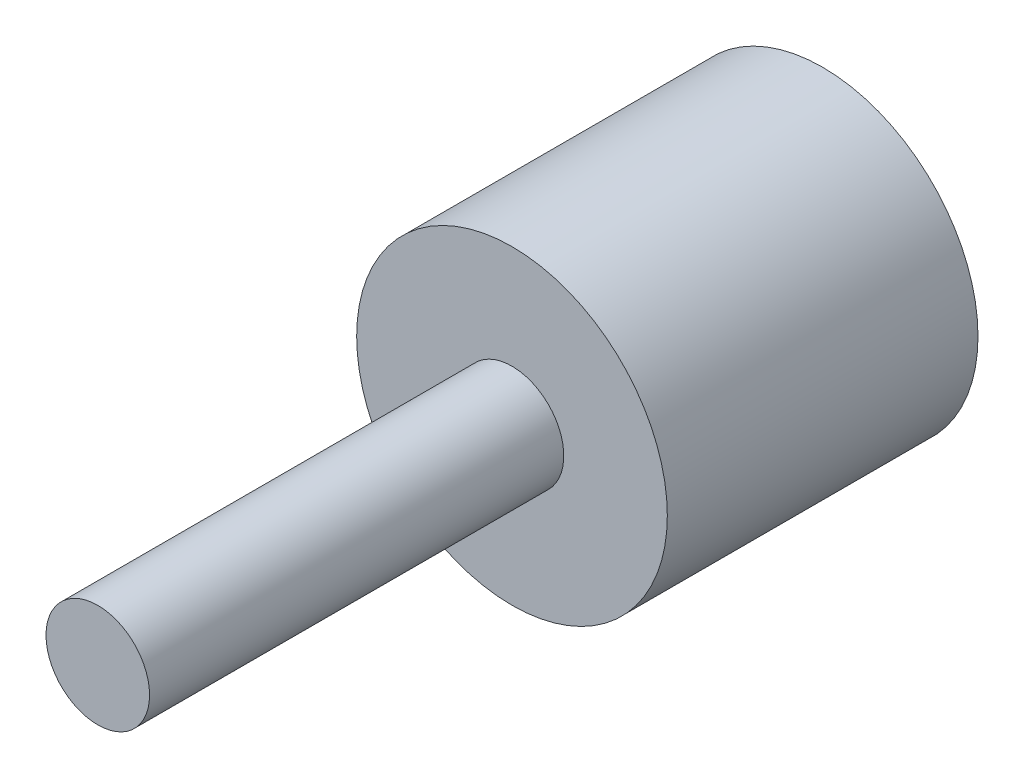
ISO-10303-21;
HEADER;
FILE_DESCRIPTION(('STEP AP214'),'2;1');
FILE_NAME('part.step','',(''),(''),'','','');
FILE_SCHEMA(('AUTOMOTIVE_DESIGN { 1 0 10303 214 1 1 1 1 }'));
ENDSEC;
DATA;
#1=APPLICATION_CONTEXT('core data for automotive mechanical design processes');
#2=APPLICATION_PROTOCOL_DEFINITION('international standard','automotive_design',2000,#1);
#3=PRODUCT_CONTEXT('',#1,'mechanical');
#4=PRODUCT('Part','Part','',(#3));
#5=PRODUCT_RELATED_PRODUCT_CATEGORY('part','',(#4));
#6=PRODUCT_DEFINITION_FORMATION('','',#4);
#7=PRODUCT_DEFINITION_CONTEXT('part definition',#1,'design');
#8=PRODUCT_DEFINITION('design','',#6,#7);
#9=PRODUCT_DEFINITION_SHAPE('','',#8);
#10=(LENGTH_UNIT() NAMED_UNIT(*) SI_UNIT(.MILLI.,.METRE.));
#11=(NAMED_UNIT(*) PLANE_ANGLE_UNIT() SI_UNIT($,.RADIAN.));
#12=(NAMED_UNIT(*) SI_UNIT($,.STERADIAN.) SOLID_ANGLE_UNIT());
#13=UNCERTAINTY_MEASURE_WITH_UNIT(LENGTH_MEASURE(1.E-05),#10,'distance_accuracy_value','');
#14=(GEOMETRIC_REPRESENTATION_CONTEXT(3) GLOBAL_UNCERTAINTY_ASSIGNED_CONTEXT((#13)) GLOBAL_UNIT_ASSIGNED_CONTEXT((#10,
#11,#12)) REPRESENTATION_CONTEXT('',''));
#15=CARTESIAN_POINT('',(0.,0.,0.));
#16=DIRECTION('',(0.,0.,1.));
#17=DIRECTION('',(1.,0.,0.));
#18=AXIS2_PLACEMENT_3D('',#15,#16,#17);
#19=CARTESIAN_POINT('',(0.,0.,15.));
#20=DIRECTION('',(0.,0.,-1.));
#21=DIRECTION('',(-1.,0.,0.));
#22=AXIS2_PLACEMENT_3D('',#19,#20,#21);
#23=CYLINDRICAL_SURFACE('',#22,7.5);
#24=CARTESIAN_POINT('',(0.,0.,15.));
#25=DIRECTION('',(0.,0.,1.));
#26=DIRECTION('',(1.,0.,0.));
#27=AXIS2_PLACEMENT_3D('',#24,#25,#26);
#28=CIRCLE('',#27,7.5);
#29=CARTESIAN_POINT('',(7.5,0.,15.));
#30=VERTEX_POINT('',#29);
#31=EDGE_CURVE('E47',#30,#30,#28,.T.);
#32=ORIENTED_EDGE('',*,*,#31,.F.);
#33=EDGE_LOOP('',(#32));
#34=FACE_BOUND('',#33,.T.);
#35=CARTESIAN_POINT('',(0.,0.,0.));
#36=DIRECTION('',(0.,0.,1.));
#37=DIRECTION('',(1.,0.,0.));
#38=AXIS2_PLACEMENT_3D('',#35,#36,#37);
#39=CIRCLE('',#38,7.5);
#40=CARTESIAN_POINT('',(7.5,0.,0.));
#41=VERTEX_POINT('',#40);
#42=EDGE_CURVE('E53',#41,#41,#39,.T.);
#43=ORIENTED_EDGE('',*,*,#42,.T.);
#44=EDGE_LOOP('',(#43));
#45=FACE_BOUND('',#44,.T.);
#46=ADVANCED_FACE('F39',(#34,#45),#23,.T.);
#47=CARTESIAN_POINT('',(0.,0.,15.));
#48=DIRECTION('',(0.,0.,1.));
#49=DIRECTION('',(1.,0.,0.));
#50=AXIS2_PLACEMENT_3D('',#47,#48,#49);
#51=PLANE('',#50);
#52=CARTESIAN_POINT('',(0.,0.,15.));
#53=DIRECTION('',(0.,0.,-1.));
#54=DIRECTION('',(-1.,0.,0.));
#55=AXIS2_PLACEMENT_3D('',#52,#53,#54);
#56=CIRCLE('',#55,2.5);
#57=CARTESIAN_POINT('',(-2.5,0.,15.));
#58=VERTEX_POINT('',#57);
#59=EDGE_CURVE('E43',#58,#58,#56,.T.);
#60=ORIENTED_EDGE('',*,*,#59,.T.);
#61=EDGE_LOOP('',(#60));
#62=FACE_BOUND('',#61,.T.);
#63=ORIENTED_EDGE('',*,*,#31,.T.);
#64=EDGE_LOOP('',(#63));
#65=FACE_BOUND('',#64,.T.);
#66=ADVANCED_FACE('F60',(#62,#65),#51,.T.);
#67=CARTESIAN_POINT('',(0.,0.,0.));
#68=DIRECTION('',(0.,0.,1.));
#69=DIRECTION('',(1.,0.,0.));
#70=AXIS2_PLACEMENT_3D('',#67,#68,#69);
#71=PLANE('',#70);
#72=CARTESIAN_POINT('',(0.,0.,0.));
#73=DIRECTION('',(0.,0.,-1.));
#74=DIRECTION('',(-1.,0.,0.));
#75=AXIS2_PLACEMENT_3D('',#72,#73,#74);
#76=CIRCLE('',#75,2.5);
#77=CARTESIAN_POINT('',(-2.5,0.,0.));
#78=VERTEX_POINT('',#77);
#79=EDGE_CURVE('E11',#78,#78,#76,.T.);
#80=ORIENTED_EDGE('',*,*,#79,.F.);
#81=EDGE_LOOP('',(#80));
#82=FACE_BOUND('',#81,.T.);
#83=ORIENTED_EDGE('',*,*,#42,.F.);
#84=EDGE_LOOP('',(#83));
#85=FACE_BOUND('',#84,.T.);
#86=ADVANCED_FACE('F64',(#82,#85),#71,.F.);
#87=CARTESIAN_POINT('',(0.,0.,15.));
#88=DIRECTION('',(0.,0.,-1.));
#89=DIRECTION('',(-1.,0.,0.));
#90=AXIS2_PLACEMENT_3D('',#87,#88,#89);
#91=CYLINDRICAL_SURFACE('',#90,2.5);
#92=ORIENTED_EDGE('',*,*,#59,.F.);
#93=EDGE_LOOP('',(#92));
#94=FACE_BOUND('',#93,.T.);
#95=ORIENTED_EDGE('',*,*,#79,.T.);
#96=EDGE_LOOP('',(#95));
#97=FACE_BOUND('',#96,.T.);
#98=ADVANCED_FACE('F41',(#94,#97),#91,.F.);
#99=CLOSED_SHELL('',(#46,#66,#86,#98));
#100=MANIFOLD_SOLID_BREP('B2',#99);
#101=CARTESIAN_POINT('',(0.,0.,35.));
#102=DIRECTION('',(0.,0.,1.));
#103=DIRECTION('',(1.,0.,0.));
#104=AXIS2_PLACEMENT_3D('',#101,#102,#103);
#105=PLANE('',#104);
#106=CARTESIAN_POINT('',(0.,0.,35.));
#107=DIRECTION('',(0.,0.,1.));
#108=DIRECTION('',(1.,0.,0.));
#109=AXIS2_PLACEMENT_3D('',#106,#107,#108);
#110=CIRCLE('',#109,2.5);
#111=CARTESIAN_POINT('',(2.5,0.,35.));
#112=VERTEX_POINT('',#111);
#113=EDGE_CURVE('E38',#112,#112,#110,.T.);
#114=ORIENTED_EDGE('',*,*,#113,.T.);
#115=EDGE_LOOP('',(#114));
#116=FACE_BOUND('',#115,.T.);
#117=ADVANCED_FACE('F101',(#116),#105,.T.);
#118=CARTESIAN_POINT('',(0.,0.,35.));
#119=DIRECTION('',(0.,0.,-1.));
#120=DIRECTION('',(-1.,0.,0.));
#121=AXIS2_PLACEMENT_3D('',#118,#119,#120);
#122=CYLINDRICAL_SURFACE('',#121,2.5);
#123=ORIENTED_EDGE('',*,*,#113,.F.);
#124=EDGE_LOOP('',(#123));
#125=FACE_BOUND('',#124,.T.);
#126=CARTESIAN_POINT('',(0.,0.,15.));
#127=DIRECTION('',(0.,0.,-1.));
#128=DIRECTION('',(-1.,0.,0.));
#129=AXIS2_PLACEMENT_3D('',#126,#127,#128);
#130=CIRCLE('',#129,2.5);
#131=CARTESIAN_POINT('',(-2.5,0.,15.));
#132=VERTEX_POINT('',#131);
#133=EDGE_CURVE('E108',#132,#132,#130,.T.);
#134=ORIENTED_EDGE('',*,*,#133,.F.);
#135=EDGE_LOOP('',(#134));
#136=FACE_BOUND('',#135,.T.);
#137=ADVANCED_FACE('F103',(#125,#136),#122,.T.);
#138=CARTESIAN_POINT('',(0.,0.,15.));
#139=DIRECTION('',(0.,0.,-1.));
#140=DIRECTION('',(-1.,0.,0.));
#141=AXIS2_PLACEMENT_3D('',#138,#139,#140);
#142=PLANE('',#141);
#143=ORIENTED_EDGE('',*,*,#133,.T.);
#144=EDGE_LOOP('',(#143));
#145=FACE_BOUND('',#144,.T.);
#146=ADVANCED_FACE('F114',(#145),#142,.T.);
#147=CLOSED_SHELL('',(#117,#137,#146));
#148=MANIFOLD_SOLID_BREP('B6',#147);
#149=ADVANCED_BREP_SHAPE_REPRESENTATION('',(#18,#100,#148),#14);
#150=SHAPE_DEFINITION_REPRESENTATION(#9,#149);
ENDSEC;
END-ISO-10303-21;
